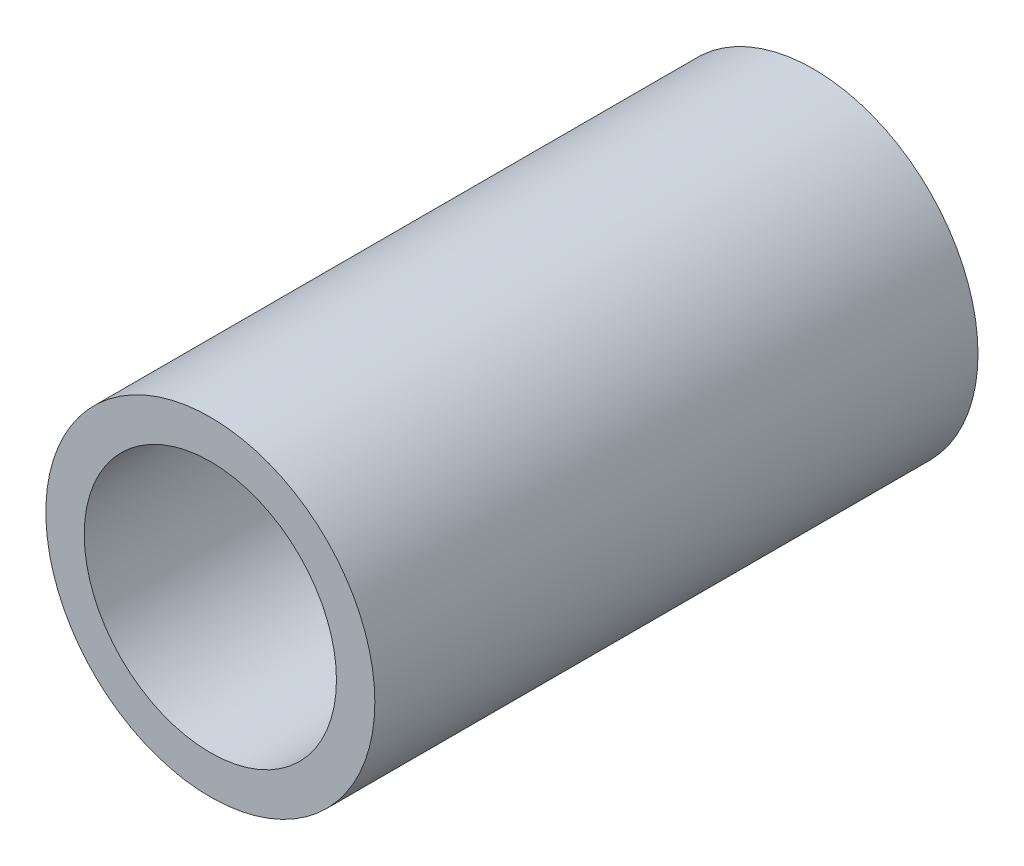
ISO-10303-21;
HEADER;
FILE_DESCRIPTION(('STEP AP214'),'2;1');
FILE_NAME('part.step','',(''),(''),'','','');
FILE_SCHEMA(('AUTOMOTIVE_DESIGN { 1 0 10303 214 1 1 1 1 }'));
ENDSEC;
DATA;
#1=APPLICATION_CONTEXT('core data for automotive mechanical design processes');
#2=APPLICATION_PROTOCOL_DEFINITION('international standard','automotive_design',2000,#1);
#3=PRODUCT_CONTEXT('',#1,'mechanical');
#4=PRODUCT('Part','Part','',(#3));
#5=PRODUCT_RELATED_PRODUCT_CATEGORY('part','',(#4));
#6=PRODUCT_DEFINITION_FORMATION('','',#4);
#7=PRODUCT_DEFINITION_CONTEXT('part definition',#1,'design');
#8=PRODUCT_DEFINITION('design','',#6,#7);
#9=PRODUCT_DEFINITION_SHAPE('','',#8);
#10=(LENGTH_UNIT() NAMED_UNIT(*) SI_UNIT(.MILLI.,.METRE.));
#11=(NAMED_UNIT(*) PLANE_ANGLE_UNIT() SI_UNIT($,.RADIAN.));
#12=(NAMED_UNIT(*) SI_UNIT($,.STERADIAN.) SOLID_ANGLE_UNIT());
#13=UNCERTAINTY_MEASURE_WITH_UNIT(LENGTH_MEASURE(1.E-05),#10,'distance_accuracy_value','');
#14=(GEOMETRIC_REPRESENTATION_CONTEXT(3) GLOBAL_UNCERTAINTY_ASSIGNED_CONTEXT((#13)) GLOBAL_UNIT_ASSIGNED_CONTEXT((#10,
#11,#12)) REPRESENTATION_CONTEXT('',''));
#15=CARTESIAN_POINT('',(0.,0.,0.));
#16=DIRECTION('',(0.,0.,1.));
#17=DIRECTION('',(1.,0.,0.));
#18=AXIS2_PLACEMENT_3D('',#15,#16,#17);
#19=CARTESIAN_POINT('',(0.,0.,110.));
#20=DIRECTION('',(0.,0.,1.));
#21=DIRECTION('',(1.,0.,0.));
#22=AXIS2_PLACEMENT_3D('',#19,#20,#21);
#23=PLANE('',#22);
#24=CARTESIAN_POINT('',(0.,0.,110.));
#25=DIRECTION('',(0.,0.,1.));
#26=DIRECTION('',(1.,0.,0.));
#27=AXIS2_PLACEMENT_3D('',#24,#25,#26);
#28=CIRCLE('',#27,30.);
#29=CARTESIAN_POINT('',(30.,0.,110.));
#30=VERTEX_POINT('',#29);
#31=EDGE_CURVE('E10',#30,#30,#28,.T.);
#32=ORIENTED_EDGE('',*,*,#31,.T.);
#33=EDGE_LOOP('',(#32));
#34=FACE_BOUND('',#33,.T.);
#35=CARTESIAN_POINT('',(0.,0.,110.));
#36=DIRECTION('',(0.,0.,1.));
#37=DIRECTION('',(1.,0.,0.));
#38=AXIS2_PLACEMENT_3D('',#35,#36,#37);
#39=CIRCLE('',#38,23.);
#40=CARTESIAN_POINT('',(23.,0.,110.));
#41=VERTEX_POINT('',#40);
#42=EDGE_CURVE('E42',#41,#41,#39,.T.);
#43=ORIENTED_EDGE('',*,*,#42,.F.);
#44=EDGE_LOOP('',(#43));
#45=FACE_BOUND('',#44,.T.);
#46=ADVANCED_FACE('F31',(#34,#45),#23,.T.);
#47=CARTESIAN_POINT('',(0.,0.,0.));
#48=DIRECTION('',(0.,0.,1.));
#49=DIRECTION('',(1.,0.,0.));
#50=AXIS2_PLACEMENT_3D('',#47,#48,#49);
#51=PLANE('',#50);
#52=CARTESIAN_POINT('',(0.,0.,0.));
#53=DIRECTION('',(0.,0.,1.));
#54=DIRECTION('',(1.,0.,0.));
#55=AXIS2_PLACEMENT_3D('',#52,#53,#54);
#56=CIRCLE('',#55,30.);
#57=CARTESIAN_POINT('',(30.,0.,0.));
#58=VERTEX_POINT('',#57);
#59=EDGE_CURVE('E35',#58,#58,#56,.T.);
#60=ORIENTED_EDGE('',*,*,#59,.F.);
#61=EDGE_LOOP('',(#60));
#62=FACE_BOUND('',#61,.T.);
#63=CARTESIAN_POINT('',(0.,0.,0.));
#64=DIRECTION('',(0.,0.,1.));
#65=DIRECTION('',(1.,0.,0.));
#66=AXIS2_PLACEMENT_3D('',#63,#64,#65);
#67=CIRCLE('',#66,23.);
#68=CARTESIAN_POINT('',(23.,0.,0.));
#69=VERTEX_POINT('',#68);
#70=EDGE_CURVE('E44',#69,#69,#67,.T.);
#71=ORIENTED_EDGE('',*,*,#70,.T.);
#72=EDGE_LOOP('',(#71));
#73=FACE_BOUND('',#72,.T.);
#74=ADVANCED_FACE('F54',(#62,#73),#51,.F.);
#75=CARTESIAN_POINT('',(0.,0.,110.));
#76=DIRECTION('',(0.,0.,-1.));
#77=DIRECTION('',(-1.,0.,0.));
#78=AXIS2_PLACEMENT_3D('',#75,#76,#77);
#79=CYLINDRICAL_SURFACE('',#78,30.);
#80=ORIENTED_EDGE('',*,*,#31,.F.);
#81=EDGE_LOOP('',(#80));
#82=FACE_BOUND('',#81,.T.);
#83=ORIENTED_EDGE('',*,*,#59,.T.);
#84=EDGE_LOOP('',(#83));
#85=FACE_BOUND('',#84,.T.);
#86=ADVANCED_FACE('F33',(#82,#85),#79,.T.);
#87=CARTESIAN_POINT('',(0.,0.,110.));
#88=DIRECTION('',(0.,0.,-1.));
#89=DIRECTION('',(-1.,0.,0.));
#90=AXIS2_PLACEMENT_3D('',#87,#88,#89);
#91=CYLINDRICAL_SURFACE('',#90,23.);
#92=ORIENTED_EDGE('',*,*,#42,.T.);
#93=EDGE_LOOP('',(#92));
#94=FACE_BOUND('',#93,.T.);
#95=ORIENTED_EDGE('',*,*,#70,.F.);
#96=EDGE_LOOP('',(#95));
#97=FACE_BOUND('',#96,.T.);
#98=ADVANCED_FACE('F50',(#94,#97),#91,.F.);
#99=CLOSED_SHELL('',(#46,#74,#86,#98));
#100=MANIFOLD_SOLID_BREP('B2',#99);
#101=ADVANCED_BREP_SHAPE_REPRESENTATION('',(#18,#100),#14);
#102=SHAPE_DEFINITION_REPRESENTATION(#9,#101);
ENDSEC;
END-ISO-10303-21;
